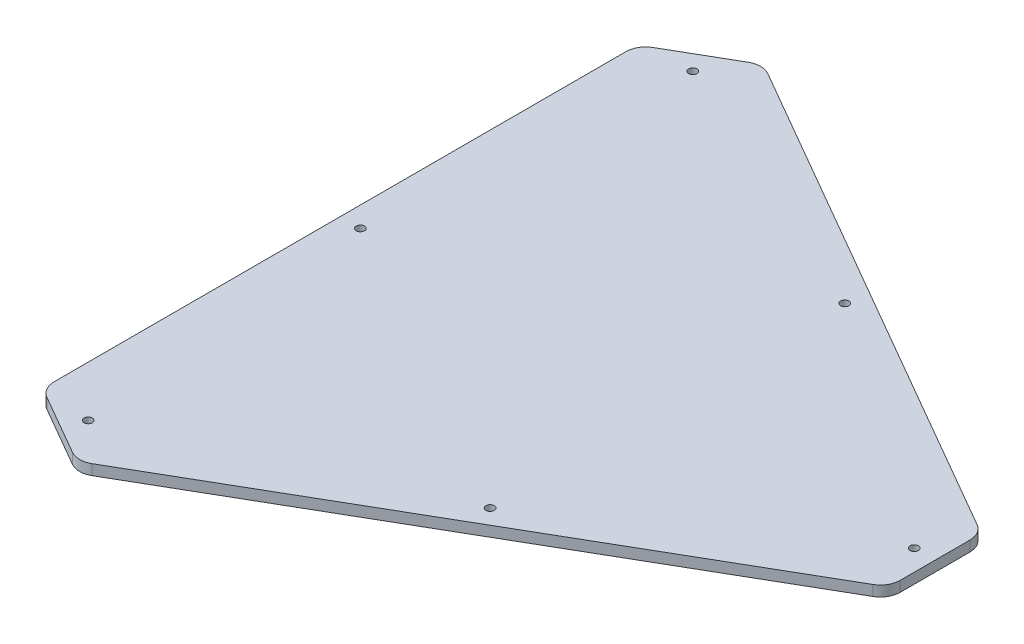
ISO-10303-21;
HEADER;
FILE_DESCRIPTION(('STEP AP214'),'2;1');
FILE_NAME('part.step','',(''),(''),'','','');
FILE_SCHEMA(('AUTOMOTIVE_DESIGN { 1 0 10303 214 1 1 1 1 }'));
ENDSEC;
DATA;
#1=APPLICATION_CONTEXT('core data for automotive mechanical design processes');
#2=APPLICATION_PROTOCOL_DEFINITION('international standard','automotive_design',2000,#1);
#3=PRODUCT_CONTEXT('',#1,'mechanical');
#4=PRODUCT('Part','Part','',(#3));
#5=PRODUCT_RELATED_PRODUCT_CATEGORY('part','',(#4));
#6=PRODUCT_DEFINITION_FORMATION('','',#4);
#7=PRODUCT_DEFINITION_CONTEXT('part definition',#1,'design');
#8=PRODUCT_DEFINITION('design','',#6,#7);
#9=PRODUCT_DEFINITION_SHAPE('','',#8);
#10=(LENGTH_UNIT() NAMED_UNIT(*) SI_UNIT(.MILLI.,.METRE.));
#11=(NAMED_UNIT(*) PLANE_ANGLE_UNIT() SI_UNIT($,.RADIAN.));
#12=(NAMED_UNIT(*) SI_UNIT($,.STERADIAN.) SOLID_ANGLE_UNIT());
#13=UNCERTAINTY_MEASURE_WITH_UNIT(LENGTH_MEASURE(1.E-05),#10,'distance_accuracy_value','');
#14=(GEOMETRIC_REPRESENTATION_CONTEXT(3) GLOBAL_UNCERTAINTY_ASSIGNED_CONTEXT((#13)) GLOBAL_UNIT_ASSIGNED_CONTEXT((#10,
#11,#12)) REPRESENTATION_CONTEXT('',''));
#15=CARTESIAN_POINT('',(0.,0.,0.));
#16=DIRECTION('',(0.,0.,1.));
#17=DIRECTION('',(1.,0.,0.));
#18=AXIS2_PLACEMENT_3D('',#15,#16,#17);
#19=CARTESIAN_POINT('',(0.,-90.,0.));
#20=DIRECTION('',(0.,1.,0.));
#21=DIRECTION('',(-0.866025403784432,0.,0.500000000000011));
#22=AXIS2_PLACEMENT_3D('',#19,#20,#21);
#23=PLANE('',#22);
#24=CARTESIAN_POINT('',(49.1033573777246,-90.,-85.0495098004314));
#25=DIRECTION('',(0.,-1.,0.));
#26=DIRECTION('',(-0.866025403784432,0.,0.500000000000011));
#27=AXIS2_PLACEMENT_3D('',#24,#25,#26);
#28=CIRCLE('',#27,2.);
#29=CARTESIAN_POINT('',(47.3713065701558,-90.,-84.0495098004314));
#30=VERTEX_POINT('',#29);
#31=EDGE_CURVE('E235',#30,#30,#28,.T.);
#32=ORIENTED_EDGE('',*,*,#31,.T.);
#33=EDGE_LOOP('',(#32));
#34=FACE_BOUND('',#33,.T.);
#35=CARTESIAN_POINT('',(168.,-90.,-16.6931763113128));
#36=DIRECTION('',(0.,1.,0.));
#37=DIRECTION('',(0.,0.,1.));
#38=AXIS2_PLACEMENT_3D('',#35,#36,#37);
#39=CIRCLE('',#38,9.50000000000001);
#40=CARTESIAN_POINT('',(172.75,-90.,-24.920417647265));
#41=VERTEX_POINT('',#40);
#42=CARTESIAN_POINT('',(177.5,-90.,-16.6931763113128));
#43=VERTEX_POINT('',#42);
#44=EDGE_CURVE('E197',#41,#43,#39,.F.);
#45=ORIENTED_EDGE('',*,*,#44,.F.);
#46=DIRECTION('',(-0.866025403784446,0.,-0.499999999999988));
#47=VECTOR('',#46,1.);
#48=CARTESIAN_POINT('',(53.9783573777235,-90.,-93.4932574873304));
#49=LINE('',#48,#47);
#50=CARTESIAN_POINT('',(-64.7932852445527,-90.,-162.066097327393));
#51=VERTEX_POINT('',#50);
#52=EDGE_CURVE('E244',#41,#51,#49,.T.);
#53=ORIENTED_EDGE('',*,*,#52,.T.);
#54=CARTESIAN_POINT('',(-69.5432852445526,-90.,-153.838855991441));
#55=DIRECTION('',(0.,-1.,0.));
#56=DIRECTION('',(-0.866025403784432,0.,0.500000000000011));
#57=AXIS2_PLACEMENT_3D('',#54,#55,#56);
#58=CIRCLE('',#57,9.50000000000001);
#59=CARTESIAN_POINT('',(-74.2932852445527,-90.,-162.066097327393));
#60=VERTEX_POINT('',#59);
#61=EDGE_CURVE('E248',#51,#60,#58,.F.);
#62=ORIENTED_EDGE('',*,*,#61,.T.);
#63=DIRECTION('',(-0.866025403784432,0.,0.500000000000011));
#64=VECTOR('',#63,1.);
#65=CARTESIAN_POINT('',(-88.7500000000021,-90.,-153.719509171737));
#66=LINE('',#65,#64);
#67=CARTESIAN_POINT('',(-103.206714755452,-90.,-145.37292101608));
#68=VERTEX_POINT('',#67);
#69=EDGE_CURVE('E43',#60,#68,#66,.T.);
#70=ORIENTED_EDGE('',*,*,#69,.T.);
#71=CARTESIAN_POINT('',(-98.4567147554514,-90.,-137.145679680128));
#72=DIRECTION('',(0.,1.,0.));
#73=DIRECTION('',(0.866025403784432,0.,-0.500000000000011));
#74=AXIS2_PLACEMENT_3D('',#71,#72,#73);
#75=CIRCLE('',#74,9.50000000000001);
#76=CARTESIAN_POINT('',(-107.956714755451,-90.,-137.145679680128));
#77=VERTEX_POINT('',#76);
#78=EDGE_CURVE('E221',#77,#68,#75,.F.);
#79=ORIENTED_EDGE('',*,*,#78,.F.);
#80=DIRECTION('',(0.,0.,-1.));
#81=VECTOR('',#80,1.);
#82=CARTESIAN_POINT('',(-107.95671475545,-90.,1.40165656858926E-12));
#83=LINE('',#82,#81);
#84=CARTESIAN_POINT('',(-107.956714755451,-90.,137.145679680128));
#85=VERTEX_POINT('',#84);
#86=EDGE_CURVE('E217',#85,#77,#83,.T.);
#87=ORIENTED_EDGE('',*,*,#86,.F.);
#88=CARTESIAN_POINT('',(-98.4567147554514,-90.,137.145679680128));
#89=DIRECTION('',(0.,-1.,0.));
#90=DIRECTION('',(0.866025403784432,0.,0.500000000000011));
#91=AXIS2_PLACEMENT_3D('',#88,#89,#90);
#92=CIRCLE('',#91,9.50000000000001);
#93=CARTESIAN_POINT('',(-103.206714755452,-90.,145.37292101608));
#94=VERTEX_POINT('',#93);
#95=EDGE_CURVE('E161',#85,#94,#92,.F.);
#96=ORIENTED_EDGE('',*,*,#95,.T.);
#97=DIRECTION('',(0.866025403784432,0.,0.500000000000011));
#98=VECTOR('',#97,1.);
#99=CARTESIAN_POINT('',(-88.7500000000021,-90.,153.719509171737));
#100=LINE('',#99,#98);
#101=CARTESIAN_POINT('',(-74.2932852445527,-90.,162.066097327393));
#102=VERTEX_POINT('',#101);
#103=EDGE_CURVE('E148',#94,#102,#100,.T.);
#104=ORIENTED_EDGE('',*,*,#103,.T.);
#105=CARTESIAN_POINT('',(-69.5432852445526,-90.,153.838855991441));
#106=DIRECTION('',(0.,1.,0.));
#107=DIRECTION('',(-0.866025403784432,0.,-0.500000000000011));
#108=AXIS2_PLACEMENT_3D('',#105,#106,#107);
#109=CIRCLE('',#108,9.50000000000001);
#110=CARTESIAN_POINT('',(-64.7932852445527,-90.,162.066097327393));
#111=VERTEX_POINT('',#110);
#112=EDGE_CURVE('E139',#111,#102,#109,.F.);
#113=ORIENTED_EDGE('',*,*,#112,.F.);
#114=DIRECTION('',(0.866025403784438,0.,-0.5));
#115=VECTOR('',#114,1.);
#116=CARTESIAN_POINT('',(53.9783573777248,-90.,93.4932574873296));
#117=LINE('',#116,#115);
#118=CARTESIAN_POINT('',(172.75,-90.,24.920417647265));
#119=VERTEX_POINT('',#118);
#120=EDGE_CURVE('E123',#111,#119,#117,.T.);
#121=ORIENTED_EDGE('',*,*,#120,.T.);
#122=CARTESIAN_POINT('',(168.,-90.,16.6931763113128));
#123=DIRECTION('',(0.,-1.,0.));
#124=DIRECTION('',(0.,0.,-1.));
#125=AXIS2_PLACEMENT_3D('',#122,#123,#124);
#126=CIRCLE('',#125,9.50000000000001);
#127=CARTESIAN_POINT('',(177.5,-90.,16.6931763113128));
#128=VERTEX_POINT('',#127);
#129=EDGE_CURVE('E179',#119,#128,#126,.F.);
#130=ORIENTED_EDGE('',*,*,#129,.T.);
#131=DIRECTION('',(0.,0.,1.));
#132=VECTOR('',#131,1.);
#133=CARTESIAN_POINT('',(177.5,-90.,0.));
#134=LINE('',#133,#132);
#135=EDGE_CURVE('E200',#43,#128,#134,.T.);
#136=ORIENTED_EDGE('',*,*,#135,.F.);
#137=EDGE_LOOP('',(#45,#53,#62,#70,#79,#87,#96,#104,#113,#121,#130,#136));
#138=FACE_BOUND('',#137,.T.);
#139=CARTESIAN_POINT('',(-98.2067147554495,-90.,2.50494069931051E-12));
#140=DIRECTION('',(0.,1.,0.));
#141=DIRECTION('',(0.866025403784432,0.,-0.500000000000011));
#142=AXIS2_PLACEMENT_3D('',#139,#140,#141);
#143=CIRCLE('',#142,2.);
#144=CARTESIAN_POINT('',(-96.4746639478807,-90.,-0.99999999999752));
#145=VERTEX_POINT('',#144);
#146=EDGE_CURVE('E214',#145,#145,#143,.T.);
#147=ORIENTED_EDGE('',*,*,#146,.F.);
#148=EDGE_LOOP('',(#147));
#149=FACE_BOUND('',#148,.T.);
#150=CARTESIAN_POINT('',(-83.750000000002,-90.,-145.059255133892));
#151=DIRECTION('',(0.,-1.,0.));
#152=DIRECTION('',(-0.866025403784432,0.,0.500000000000011));
#153=AXIS2_PLACEMENT_3D('',#150,#151,#152);
#154=CIRCLE('',#153,2.);
#155=CARTESIAN_POINT('',(-85.4820508075709,-90.,-144.059255133892));
#156=VERTEX_POINT('',#155);
#157=EDGE_CURVE('E241',#156,#156,#154,.T.);
#158=ORIENTED_EDGE('',*,*,#157,.T.);
#159=EDGE_LOOP('',(#158));
#160=FACE_BOUND('',#159,.T.);
#161=CARTESIAN_POINT('',(49.1033573777237,-90.,85.049509800432));
#162=DIRECTION('',(0.,-1.,0.));
#163=DIRECTION('',(0.,0.,-1.));
#164=AXIS2_PLACEMENT_3D('',#161,#162,#163);
#165=CIRCLE('',#164,2.);
#166=CARTESIAN_POINT('',(49.1033573777237,-90.,83.049509800432));
#167=VERTEX_POINT('',#166);
#168=EDGE_CURVE('E134',#167,#167,#165,.T.);
#169=ORIENTED_EDGE('',*,*,#168,.T.);
#170=EDGE_LOOP('',(#169));
#171=FACE_BOUND('',#170,.T.);
#172=CARTESIAN_POINT('',(167.5,-90.,0.));
#173=DIRECTION('',(0.,1.,0.));
#174=DIRECTION('',(0.,0.,1.));
#175=AXIS2_PLACEMENT_3D('',#172,#173,#174);
#176=CIRCLE('',#175,2.);
#177=CARTESIAN_POINT('',(167.5,-90.,2.));
#178=VERTEX_POINT('',#177);
#179=EDGE_CURVE('E193',#178,#178,#176,.T.);
#180=ORIENTED_EDGE('',*,*,#179,.F.);
#181=EDGE_LOOP('',(#180));
#182=FACE_BOUND('',#181,.T.);
#183=CARTESIAN_POINT('',(-83.750000000002,-90.,145.059255133892));
#184=DIRECTION('',(0.,-1.,0.));
#185=DIRECTION('',(0.866025403784432,0.,0.500000000000011));
#186=AXIS2_PLACEMENT_3D('',#183,#184,#185);
#187=CIRCLE('',#186,2.);
#188=CARTESIAN_POINT('',(-82.0179491924332,-90.,146.059255133892));
#189=VERTEX_POINT('',#188);
#190=EDGE_CURVE('E157',#189,#189,#187,.T.);
#191=ORIENTED_EDGE('',*,*,#190,.T.);
#192=EDGE_LOOP('',(#191));
#193=FACE_BOUND('',#192,.T.);
#194=ADVANCED_FACE('F35',(#34,#138,#149,#160,#171,#182,#193),#23,.T.);
#195=CARTESIAN_POINT('',(0.,-95.,0.));
#196=DIRECTION('',(0.,1.,0.));
#197=DIRECTION('',(-0.866025403784432,0.,0.500000000000011));
#198=AXIS2_PLACEMENT_3D('',#195,#196,#197);
#199=PLANE('',#198);
#200=CARTESIAN_POINT('',(49.1033573777246,-95.,-85.0495098004314));
#201=DIRECTION('',(0.,1.,0.));
#202=DIRECTION('',(0.866025403784432,0.,-0.500000000000011));
#203=AXIS2_PLACEMENT_3D('',#200,#201,#202);
#204=CIRCLE('',#203,2.);
#205=CARTESIAN_POINT('',(50.8354081852935,-95.,-86.0495098004314));
#206=VERTEX_POINT('',#205);
#207=EDGE_CURVE('E232',#206,#206,#204,.T.);
#208=ORIENTED_EDGE('',*,*,#207,.T.);
#209=EDGE_LOOP('',(#208));
#210=FACE_BOUND('',#209,.T.);
#211=DIRECTION('',(0.866025403784446,0.,0.499999999999988));
#212=VECTOR('',#211,1.);
#213=CARTESIAN_POINT('',(-0.148230358803389,-95.,-124.743257487329));
#214=LINE('',#213,#212);
#215=CARTESIAN_POINT('',(-64.7932852445527,-95.,-162.066097327393));
#216=VERTEX_POINT('',#215);
#217=CARTESIAN_POINT('',(172.75,-95.,-24.920417647265));
#218=VERTEX_POINT('',#217);
#219=EDGE_CURVE('E251',#216,#218,#214,.T.);
#220=ORIENTED_EDGE('',*,*,#219,.T.);
#221=CARTESIAN_POINT('',(168.,-95.,-16.6931763113128));
#222=DIRECTION('',(0.,1.,0.));
#223=DIRECTION('',(0.,0.,1.));
#224=AXIS2_PLACEMENT_3D('',#221,#222,#223);
#225=CIRCLE('',#224,9.50000000000001);
#226=CARTESIAN_POINT('',(177.5,-95.,-16.6931763113128));
#227=VERTEX_POINT('',#226);
#228=EDGE_CURVE('E203',#227,#218,#225,.T.);
#229=ORIENTED_EDGE('',*,*,#228,.F.);
#230=DIRECTION('',(0.,0.,-1.));
#231=VECTOR('',#230,1.);
#232=CARTESIAN_POINT('',(177.5,-95.,-16.6931763113128));
#233=LINE('',#232,#231);
#234=CARTESIAN_POINT('',(177.5,-95.,16.6931763113128));
#235=VERTEX_POINT('',#234);
#236=EDGE_CURVE('E202',#235,#227,#233,.T.);
#237=ORIENTED_EDGE('',*,*,#236,.F.);
#238=CARTESIAN_POINT('',(168.,-95.,16.6931763113128));
#239=DIRECTION('',(0.,-1.,0.));
#240=DIRECTION('',(0.,0.,-1.));
#241=AXIS2_PLACEMENT_3D('',#238,#239,#240);
#242=CIRCLE('',#241,9.50000000000001);
#243=CARTESIAN_POINT('',(172.75,-95.,24.920417647265));
#244=VERTEX_POINT('',#243);
#245=EDGE_CURVE('E185',#235,#244,#242,.T.);
#246=ORIENTED_EDGE('',*,*,#245,.T.);
#247=DIRECTION('',(-0.866025403784438,0.,0.5));
#248=VECTOR('',#247,1.);
#249=CARTESIAN_POINT('',(108.104945114251,-95.,62.2432574873302));
#250=LINE('',#249,#248);
#251=CARTESIAN_POINT('',(-64.7932852445527,-95.,162.066097327393));
#252=VERTEX_POINT('',#251);
#253=EDGE_CURVE('E182',#244,#252,#250,.T.);
#254=ORIENTED_EDGE('',*,*,#253,.T.);
#255=CARTESIAN_POINT('',(-69.5432852445526,-95.,153.838855991441));
#256=DIRECTION('',(0.,1.,0.));
#257=DIRECTION('',(-0.866025403784432,0.,-0.500000000000011));
#258=AXIS2_PLACEMENT_3D('',#255,#256,#257);
#259=CIRCLE('',#258,9.50000000000001);
#260=CARTESIAN_POINT('',(-74.2932852445527,-95.,162.066097327393));
#261=VERTEX_POINT('',#260);
#262=EDGE_CURVE('E141',#261,#252,#259,.T.);
#263=ORIENTED_EDGE('',*,*,#262,.F.);
#264=DIRECTION('',(-0.866025403784432,0.,-0.500000000000011));
#265=VECTOR('',#264,1.);
#266=CARTESIAN_POINT('',(-103.206714755452,-95.,145.37292101608));
#267=LINE('',#266,#265);
#268=CARTESIAN_POINT('',(-103.206714755452,-95.,145.37292101608));
#269=VERTEX_POINT('',#268);
#270=EDGE_CURVE('E165',#261,#269,#267,.T.);
#271=ORIENTED_EDGE('',*,*,#270,.T.);
#272=CARTESIAN_POINT('',(-98.4567147554514,-95.,137.145679680128));
#273=DIRECTION('',(0.,-1.,0.));
#274=DIRECTION('',(0.866025403784432,0.,0.500000000000011));
#275=AXIS2_PLACEMENT_3D('',#272,#273,#274);
#276=CIRCLE('',#275,9.50000000000001);
#277=CARTESIAN_POINT('',(-107.956714755451,-95.,137.145679680128));
#278=VERTEX_POINT('',#277);
#279=EDGE_CURVE('E166',#269,#278,#276,.T.);
#280=ORIENTED_EDGE('',*,*,#279,.T.);
#281=DIRECTION('',(0.,0.,1.));
#282=VECTOR('',#281,1.);
#283=CARTESIAN_POINT('',(-107.95671475545,-95.,-62.4999999999974));
#284=LINE('',#283,#282);
#285=CARTESIAN_POINT('',(-107.956714755451,-95.,-137.145679680128));
#286=VERTEX_POINT('',#285);
#287=EDGE_CURVE('E225',#286,#278,#284,.T.);
#288=ORIENTED_EDGE('',*,*,#287,.F.);
#289=CARTESIAN_POINT('',(-98.4567147554514,-95.,-137.145679680128));
#290=DIRECTION('',(0.,1.,0.));
#291=DIRECTION('',(0.866025403784432,0.,-0.500000000000011));
#292=AXIS2_PLACEMENT_3D('',#289,#290,#291);
#293=CIRCLE('',#292,9.50000000000001);
#294=CARTESIAN_POINT('',(-103.206714755452,-95.,-145.37292101608));
#295=VERTEX_POINT('',#294);
#296=EDGE_CURVE('E227',#295,#286,#293,.T.);
#297=ORIENTED_EDGE('',*,*,#296,.F.);
#298=DIRECTION('',(0.866025403784432,0.,-0.500000000000011));
#299=VECTOR('',#298,1.);
#300=CARTESIAN_POINT('',(-74.2932852445527,-95.,-162.066097327393));
#301=LINE('',#300,#299);
#302=CARTESIAN_POINT('',(-74.2932852445527,-95.,-162.066097327393));
#303=VERTEX_POINT('',#302);
#304=EDGE_CURVE('E11',#295,#303,#301,.T.);
#305=ORIENTED_EDGE('',*,*,#304,.T.);
#306=CARTESIAN_POINT('',(-69.5432852445526,-95.,-153.838855991441));
#307=DIRECTION('',(0.,-1.,0.));
#308=DIRECTION('',(-0.866025403784432,0.,0.500000000000011));
#309=AXIS2_PLACEMENT_3D('',#306,#307,#308);
#310=CIRCLE('',#309,9.50000000000001);
#311=EDGE_CURVE('E254',#303,#216,#310,.T.);
#312=ORIENTED_EDGE('',*,*,#311,.T.);
#313=EDGE_LOOP('',(#220,#229,#237,#246,#254,#263,#271,#280,#288,#297,#305,#312));
#314=FACE_BOUND('',#313,.T.);
#315=CARTESIAN_POINT('',(-98.2067147554495,-95.,2.50494069931051E-12));
#316=DIRECTION('',(0.,-1.,0.));
#317=DIRECTION('',(-0.866025403784432,0.,0.500000000000011));
#318=AXIS2_PLACEMENT_3D('',#315,#316,#317);
#319=CIRCLE('',#318,2.);
#320=CARTESIAN_POINT('',(-99.9387655630184,-95.,1.00000000000253));
#321=VERTEX_POINT('',#320);
#322=EDGE_CURVE('E211',#321,#321,#319,.T.);
#323=ORIENTED_EDGE('',*,*,#322,.F.);
#324=EDGE_LOOP('',(#323));
#325=FACE_BOUND('',#324,.T.);
#326=CARTESIAN_POINT('',(-83.750000000002,-95.,-145.059255133892));
#327=DIRECTION('',(0.,-1.,0.));
#328=DIRECTION('',(-0.866025403784432,0.,0.500000000000011));
#329=AXIS2_PLACEMENT_3D('',#326,#327,#328);
#330=CIRCLE('',#329,2.);
#331=CARTESIAN_POINT('',(-85.4820508075709,-95.,-144.059255133892));
#332=VERTEX_POINT('',#331);
#333=EDGE_CURVE('E238',#332,#332,#330,.T.);
#334=ORIENTED_EDGE('',*,*,#333,.F.);
#335=EDGE_LOOP('',(#334));
#336=FACE_BOUND('',#335,.T.);
#337=CARTESIAN_POINT('',(49.1033573777237,-95.,85.049509800432));
#338=DIRECTION('',(0.,1.,0.));
#339=DIRECTION('',(0.,0.,1.));
#340=AXIS2_PLACEMENT_3D('',#337,#338,#339);
#341=CIRCLE('',#340,2.);
#342=CARTESIAN_POINT('',(49.1033573777237,-95.,87.049509800432));
#343=VERTEX_POINT('',#342);
#344=EDGE_CURVE('E174',#343,#343,#341,.T.);
#345=ORIENTED_EDGE('',*,*,#344,.T.);
#346=EDGE_LOOP('',(#345));
#347=FACE_BOUND('',#346,.T.);
#348=CARTESIAN_POINT('',(167.5,-95.,0.));
#349=DIRECTION('',(0.,1.,0.));
#350=DIRECTION('',(0.,0.,1.));
#351=AXIS2_PLACEMENT_3D('',#348,#349,#350);
#352=CIRCLE('',#351,2.);
#353=CARTESIAN_POINT('',(167.5,-95.,2.));
#354=VERTEX_POINT('',#353);
#355=EDGE_CURVE('E190',#354,#354,#352,.T.);
#356=ORIENTED_EDGE('',*,*,#355,.T.);
#357=EDGE_LOOP('',(#356));
#358=FACE_BOUND('',#357,.T.);
#359=CARTESIAN_POINT('',(-83.750000000002,-95.,145.059255133892));
#360=DIRECTION('',(0.,-1.,0.));
#361=DIRECTION('',(0.866025403784432,0.,0.500000000000011));
#362=AXIS2_PLACEMENT_3D('',#359,#360,#361);
#363=CIRCLE('',#362,2.);
#364=CARTESIAN_POINT('',(-82.0179491924332,-95.,146.059255133892));
#365=VERTEX_POINT('',#364);
#366=EDGE_CURVE('E154',#365,#365,#363,.T.);
#367=ORIENTED_EDGE('',*,*,#366,.F.);
#368=EDGE_LOOP('',(#367));
#369=FACE_BOUND('',#368,.T.);
#370=ADVANCED_FACE('F37',(#210,#314,#325,#336,#347,#358,#369),#199,.F.);
#371=CARTESIAN_POINT('',(-83.750000000002,465.,-145.059255133892));
#372=DIRECTION('',(0.,-1.,0.));
#373=DIRECTION('',(0.866025403784432,0.,-0.500000000000011));
#374=AXIS2_PLACEMENT_3D('',#371,#372,#373);
#375=CYLINDRICAL_SURFACE('',#374,2.);
#376=ORIENTED_EDGE('',*,*,#333,.T.);
#377=EDGE_LOOP('',(#376));
#378=FACE_BOUND('',#377,.T.);
#379=ORIENTED_EDGE('',*,*,#157,.F.);
#380=EDGE_LOOP('',(#379));
#381=FACE_BOUND('',#380,.T.);
#382=ADVANCED_FACE('F308',(#378,#381),#375,.F.);
#383=CARTESIAN_POINT('',(-0.148230358803389,465.,-124.743257487329));
#384=DIRECTION('',(-0.499999999999988,0.,0.866025403784445));
#385=DIRECTION('',(-0.866025403784446,0.,-0.499999999999988));
#386=AXIS2_PLACEMENT_3D('',#383,#384,#385);
#387=PLANE('',#386);
#388=ORIENTED_EDGE('',*,*,#52,.F.);
#389=DIRECTION('',(0.,-1.,0.));
#390=VECTOR('',#389,1.);
#391=CARTESIAN_POINT('',(172.75,465.,-24.920417647265));
#392=LINE('',#391,#390);
#393=EDGE_CURVE('E196',#41,#218,#392,.T.);
#394=ORIENTED_EDGE('',*,*,#393,.T.);
#395=ORIENTED_EDGE('',*,*,#219,.F.);
#396=DIRECTION('',(0.,-1.,0.));
#397=VECTOR('',#396,1.);
#398=CARTESIAN_POINT('',(-64.7932852445527,465.,-162.066097327393));
#399=LINE('',#398,#397);
#400=EDGE_CURVE('E247',#51,#216,#399,.T.);
#401=ORIENTED_EDGE('',*,*,#400,.F.);
#402=EDGE_LOOP('',(#388,#394,#395,#401));
#403=FACE_BOUND('',#402,.T.);
#404=ADVANCED_FACE('F265',(#403),#387,.F.);
#405=CARTESIAN_POINT('',(-69.5432852445526,465.,-153.838855991441));
#406=DIRECTION('',(0.,-1.,0.));
#407=DIRECTION('',(0.866025403784432,0.,-0.500000000000011));
#408=AXIS2_PLACEMENT_3D('',#405,#406,#407);
#409=CYLINDRICAL_SURFACE('',#408,9.50000000000001);
#410=ORIENTED_EDGE('',*,*,#61,.F.);
#411=ORIENTED_EDGE('',*,*,#400,.T.);
#412=ORIENTED_EDGE('',*,*,#311,.F.);
#413=DIRECTION('',(0.,-1.,0.));
#414=VECTOR('',#413,1.);
#415=CARTESIAN_POINT('',(-74.2932852445527,465.,-162.066097327393));
#416=LINE('',#415,#414);
#417=EDGE_CURVE('E50',#60,#303,#416,.T.);
#418=ORIENTED_EDGE('',*,*,#417,.F.);
#419=EDGE_LOOP('',(#410,#411,#412,#418));
#420=FACE_BOUND('',#419,.T.);
#421=ADVANCED_FACE('F263',(#420),#409,.T.);
#422=CARTESIAN_POINT('',(-74.2932852445527,465.,-162.066097327393));
#423=DIRECTION('',(0.500000000000012,0.,0.866025403784432));
#424=DIRECTION('',(-0.866025403784432,0.,0.500000000000011));
#425=AXIS2_PLACEMENT_3D('',#422,#423,#424);
#426=PLANE('',#425);
#427=ORIENTED_EDGE('',*,*,#69,.F.);
#428=ORIENTED_EDGE('',*,*,#417,.T.);
#429=ORIENTED_EDGE('',*,*,#304,.F.);
#430=DIRECTION('',(0.,-1.,0.));
#431=VECTOR('',#430,1.);
#432=CARTESIAN_POINT('',(-103.206714755452,465.,-145.37292101608));
#433=LINE('',#432,#431);
#434=EDGE_CURVE('E224',#68,#295,#433,.T.);
#435=ORIENTED_EDGE('',*,*,#434,.F.);
#436=EDGE_LOOP('',(#427,#428,#429,#435));
#437=FACE_BOUND('',#436,.T.);
#438=ADVANCED_FACE('F291',(#437),#426,.F.);
#439=CARTESIAN_POINT('',(49.1033573777246,465.,-85.0495098004314));
#440=DIRECTION('',(0.,-1.,0.));
#441=DIRECTION('',(0.866025403784432,0.,-0.500000000000011));
#442=AXIS2_PLACEMENT_3D('',#439,#440,#441);
#443=CYLINDRICAL_SURFACE('',#442,2.);
#444=ORIENTED_EDGE('',*,*,#207,.F.);
#445=EDGE_LOOP('',(#444));
#446=FACE_BOUND('',#445,.T.);
#447=ORIENTED_EDGE('',*,*,#31,.F.);
#448=EDGE_LOOP('',(#447));
#449=FACE_BOUND('',#448,.T.);
#450=ADVANCED_FACE('F293',(#446,#449),#443,.F.);
#451=CARTESIAN_POINT('',(-107.95671475545,465.,-62.4999999999974));
#452=DIRECTION('',(1.,0.,0.));
#453=DIRECTION('',(0.,0.,-1.));
#454=AXIS2_PLACEMENT_3D('',#451,#452,#453);
#455=PLANE('',#454);
#456=ORIENTED_EDGE('',*,*,#86,.T.);
#457=DIRECTION('',(0.,-1.,0.));
#458=VECTOR('',#457,1.);
#459=CARTESIAN_POINT('',(-107.956714755451,465.,-137.145679680128));
#460=LINE('',#459,#458);
#461=EDGE_CURVE('E220',#77,#286,#460,.T.);
#462=ORIENTED_EDGE('',*,*,#461,.T.);
#463=ORIENTED_EDGE('',*,*,#287,.T.);
#464=DIRECTION('',(0.,-1.,0.));
#465=VECTOR('',#464,1.);
#466=CARTESIAN_POINT('',(-107.956714755451,465.,137.145679680128));
#467=LINE('',#466,#465);
#468=EDGE_CURVE('E160',#85,#278,#467,.T.);
#469=ORIENTED_EDGE('',*,*,#468,.F.);
#470=EDGE_LOOP('',(#456,#462,#463,#469));
#471=FACE_BOUND('',#470,.T.);
#472=ADVANCED_FACE('F287',(#471),#455,.F.);
#473=CARTESIAN_POINT('',(-98.4567147554514,465.,-137.145679680128));
#474=DIRECTION('',(0.,-1.,0.));
#475=DIRECTION('',(-0.866025403784432,0.,0.500000000000011));
#476=AXIS2_PLACEMENT_3D('',#473,#474,#475);
#477=CYLINDRICAL_SURFACE('',#476,9.50000000000001);
#478=ORIENTED_EDGE('',*,*,#78,.T.);
#479=ORIENTED_EDGE('',*,*,#434,.T.);
#480=ORIENTED_EDGE('',*,*,#296,.T.);
#481=ORIENTED_EDGE('',*,*,#461,.F.);
#482=EDGE_LOOP('',(#478,#479,#480,#481));
#483=FACE_BOUND('',#482,.T.);
#484=ADVANCED_FACE('F290',(#483),#477,.T.);
#485=CARTESIAN_POINT('',(-98.2067147554495,465.,2.50494069931051E-12));
#486=DIRECTION('',(0.,-1.,0.));
#487=DIRECTION('',(-0.866025403784432,0.,0.500000000000011));
#488=AXIS2_PLACEMENT_3D('',#485,#486,#487);
#489=CYLINDRICAL_SURFACE('',#488,2.);
#490=ORIENTED_EDGE('',*,*,#322,.T.);
#491=EDGE_LOOP('',(#490));
#492=FACE_BOUND('',#491,.T.);
#493=ORIENTED_EDGE('',*,*,#146,.T.);
#494=EDGE_LOOP('',(#493));
#495=FACE_BOUND('',#494,.T.);
#496=ADVANCED_FACE('F324',(#492,#495),#489,.F.);
#497=CARTESIAN_POINT('',(167.5,465.,0.));
#498=DIRECTION('',(0.,-1.,0.));
#499=DIRECTION('',(0.,0.,-1.));
#500=AXIS2_PLACEMENT_3D('',#497,#498,#499);
#501=CYLINDRICAL_SURFACE('',#500,2.);
#502=ORIENTED_EDGE('',*,*,#355,.F.);
#503=EDGE_LOOP('',(#502));
#504=FACE_BOUND('',#503,.T.);
#505=ORIENTED_EDGE('',*,*,#179,.T.);
#506=EDGE_LOOP('',(#505));
#507=FACE_BOUND('',#506,.T.);
#508=ADVANCED_FACE('F327',(#504,#507),#501,.F.);
#509=CARTESIAN_POINT('',(168.,465.,-16.6931763113128));
#510=DIRECTION('',(0.,-1.,0.));
#511=DIRECTION('',(0.,0.,-1.));
#512=AXIS2_PLACEMENT_3D('',#509,#510,#511);
#513=CYLINDRICAL_SURFACE('',#512,9.50000000000001);
#514=ORIENTED_EDGE('',*,*,#44,.T.);
#515=DIRECTION('',(0.,-1.,0.));
#516=VECTOR('',#515,1.);
#517=CARTESIAN_POINT('',(177.5,465.,-16.6931763113128));
#518=LINE('',#517,#516);
#519=EDGE_CURVE('E199',#43,#227,#518,.T.);
#520=ORIENTED_EDGE('',*,*,#519,.T.);
#521=ORIENTED_EDGE('',*,*,#228,.T.);
#522=ORIENTED_EDGE('',*,*,#393,.F.);
#523=EDGE_LOOP('',(#514,#520,#521,#522));
#524=FACE_BOUND('',#523,.T.);
#525=ADVANCED_FACE('F268',(#524),#513,.T.);
#526=CARTESIAN_POINT('',(177.5,465.,-16.6931763113128));
#527=DIRECTION('',(-1.,0.,0.));
#528=DIRECTION('',(0.,0.,1.));
#529=AXIS2_PLACEMENT_3D('',#526,#527,#528);
#530=PLANE('',#529);
#531=ORIENTED_EDGE('',*,*,#135,.T.);
#532=DIRECTION('',(0.,-1.,0.));
#533=VECTOR('',#532,1.);
#534=CARTESIAN_POINT('',(177.5,465.,16.6931763113128));
#535=LINE('',#534,#533);
#536=EDGE_CURVE('E181',#128,#235,#535,.T.);
#537=ORIENTED_EDGE('',*,*,#536,.T.);
#538=ORIENTED_EDGE('',*,*,#236,.T.);
#539=ORIENTED_EDGE('',*,*,#519,.F.);
#540=EDGE_LOOP('',(#531,#537,#538,#539));
#541=FACE_BOUND('',#540,.T.);
#542=ADVANCED_FACE('F273',(#541),#530,.F.);
#543=CARTESIAN_POINT('',(108.104945114251,465.,62.2432574873302));
#544=DIRECTION('',(-0.5,0.,-0.866025403784438));
#545=DIRECTION('',(0.866025403784438,0.,-0.5));
#546=AXIS2_PLACEMENT_3D('',#543,#544,#545);
#547=PLANE('',#546);
#548=ORIENTED_EDGE('',*,*,#120,.F.);
#549=DIRECTION('',(0.,-1.,0.));
#550=VECTOR('',#549,1.);
#551=CARTESIAN_POINT('',(-64.7932852445527,465.,162.066097327393));
#552=LINE('',#551,#550);
#553=EDGE_CURVE('E127',#111,#252,#552,.T.);
#554=ORIENTED_EDGE('',*,*,#553,.T.);
#555=ORIENTED_EDGE('',*,*,#253,.F.);
#556=DIRECTION('',(0.,-1.,0.));
#557=VECTOR('',#556,1.);
#558=CARTESIAN_POINT('',(172.75,465.,24.920417647265));
#559=LINE('',#558,#557);
#560=EDGE_CURVE('E129',#119,#244,#559,.T.);
#561=ORIENTED_EDGE('',*,*,#560,.F.);
#562=EDGE_LOOP('',(#548,#554,#555,#561));
#563=FACE_BOUND('',#562,.T.);
#564=ADVANCED_FACE('F125',(#563),#547,.F.);
#565=CARTESIAN_POINT('',(168.,465.,16.6931763113128));
#566=DIRECTION('',(0.,-1.,0.));
#567=DIRECTION('',(0.,0.,1.));
#568=AXIS2_PLACEMENT_3D('',#565,#566,#567);
#569=CYLINDRICAL_SURFACE('',#568,9.50000000000001);
#570=ORIENTED_EDGE('',*,*,#129,.F.);
#571=ORIENTED_EDGE('',*,*,#560,.T.);
#572=ORIENTED_EDGE('',*,*,#245,.F.);
#573=ORIENTED_EDGE('',*,*,#536,.F.);
#574=EDGE_LOOP('',(#570,#571,#572,#573));
#575=FACE_BOUND('',#574,.T.);
#576=ADVANCED_FACE('F276',(#575),#569,.T.);
#577=CARTESIAN_POINT('',(49.1033573777237,465.,85.049509800432));
#578=DIRECTION('',(0.,-1.,0.));
#579=DIRECTION('',(0.,0.,1.));
#580=AXIS2_PLACEMENT_3D('',#577,#578,#579);
#581=CYLINDRICAL_SURFACE('',#580,2.);
#582=ORIENTED_EDGE('',*,*,#344,.F.);
#583=EDGE_LOOP('',(#582));
#584=FACE_BOUND('',#583,.T.);
#585=ORIENTED_EDGE('',*,*,#168,.F.);
#586=EDGE_LOOP('',(#585));
#587=FACE_BOUND('',#586,.T.);
#588=ADVANCED_FACE('F340',(#584,#587),#581,.F.);
#589=CARTESIAN_POINT('',(-83.750000000002,465.,145.059255133892));
#590=DIRECTION('',(0.,-1.,0.));
#591=DIRECTION('',(-0.866025403784432,0.,-0.500000000000011));
#592=AXIS2_PLACEMENT_3D('',#589,#590,#591);
#593=CYLINDRICAL_SURFACE('',#592,2.);
#594=ORIENTED_EDGE('',*,*,#366,.T.);
#595=EDGE_LOOP('',(#594));
#596=FACE_BOUND('',#595,.T.);
#597=ORIENTED_EDGE('',*,*,#190,.F.);
#598=EDGE_LOOP('',(#597));
#599=FACE_BOUND('',#598,.T.);
#600=ADVANCED_FACE('F343',(#596,#599),#593,.F.);
#601=CARTESIAN_POINT('',(-98.4567147554514,465.,137.145679680128));
#602=DIRECTION('',(0.,-1.,0.));
#603=DIRECTION('',(-0.866025403784432,0.,-0.500000000000011));
#604=AXIS2_PLACEMENT_3D('',#601,#602,#603);
#605=CYLINDRICAL_SURFACE('',#604,9.50000000000001);
#606=ORIENTED_EDGE('',*,*,#95,.F.);
#607=ORIENTED_EDGE('',*,*,#468,.T.);
#608=ORIENTED_EDGE('',*,*,#279,.F.);
#609=DIRECTION('',(0.,-1.,0.));
#610=VECTOR('',#609,1.);
#611=CARTESIAN_POINT('',(-103.206714755452,465.,145.37292101608));
#612=LINE('',#611,#610);
#613=EDGE_CURVE('E163',#94,#269,#612,.T.);
#614=ORIENTED_EDGE('',*,*,#613,.F.);
#615=EDGE_LOOP('',(#606,#607,#608,#614));
#616=FACE_BOUND('',#615,.T.);
#617=ADVANCED_FACE('F283',(#616),#605,.T.);
#618=CARTESIAN_POINT('',(-103.206714755452,465.,145.37292101608));
#619=DIRECTION('',(0.500000000000012,0.,-0.866025403784432));
#620=DIRECTION('',(0.866025403784432,0.,0.500000000000011));
#621=AXIS2_PLACEMENT_3D('',#618,#619,#620);
#622=PLANE('',#621);
#623=ORIENTED_EDGE('',*,*,#103,.F.);
#624=ORIENTED_EDGE('',*,*,#613,.T.);
#625=ORIENTED_EDGE('',*,*,#270,.F.);
#626=DIRECTION('',(0.,-1.,0.));
#627=VECTOR('',#626,1.);
#628=CARTESIAN_POINT('',(-74.2932852445527,465.,162.066097327393));
#629=LINE('',#628,#627);
#630=EDGE_CURVE('E149',#102,#261,#629,.T.);
#631=ORIENTED_EDGE('',*,*,#630,.F.);
#632=EDGE_LOOP('',(#623,#624,#625,#631));
#633=FACE_BOUND('',#632,.T.);
#634=ADVANCED_FACE('F279',(#633),#622,.F.);
#635=CARTESIAN_POINT('',(-69.5432852445526,465.,153.838855991441));
#636=DIRECTION('',(0.,-1.,0.));
#637=DIRECTION('',(0.866025403784432,0.,0.500000000000011));
#638=AXIS2_PLACEMENT_3D('',#635,#636,#637);
#639=CYLINDRICAL_SURFACE('',#638,9.50000000000001);
#640=ORIENTED_EDGE('',*,*,#112,.T.);
#641=ORIENTED_EDGE('',*,*,#630,.T.);
#642=ORIENTED_EDGE('',*,*,#262,.T.);
#643=ORIENTED_EDGE('',*,*,#553,.F.);
#644=EDGE_LOOP('',(#640,#641,#642,#643));
#645=FACE_BOUND('',#644,.T.);
#646=ADVANCED_FACE('F138',(#645),#639,.T.);
#647=CLOSED_SHELL('',(#194,#370,#382,#404,#421,#438,#450,#472,#484,#496,#508,#525,#542,#564,
#576,#588,#600,#617,#634,#646));
#648=MANIFOLD_SOLID_BREP('B2',#647);
#649=ADVANCED_BREP_SHAPE_REPRESENTATION('',(#18,#648),#14);
#650=SHAPE_DEFINITION_REPRESENTATION(#9,#649);
ENDSEC;
END-ISO-10303-21;
